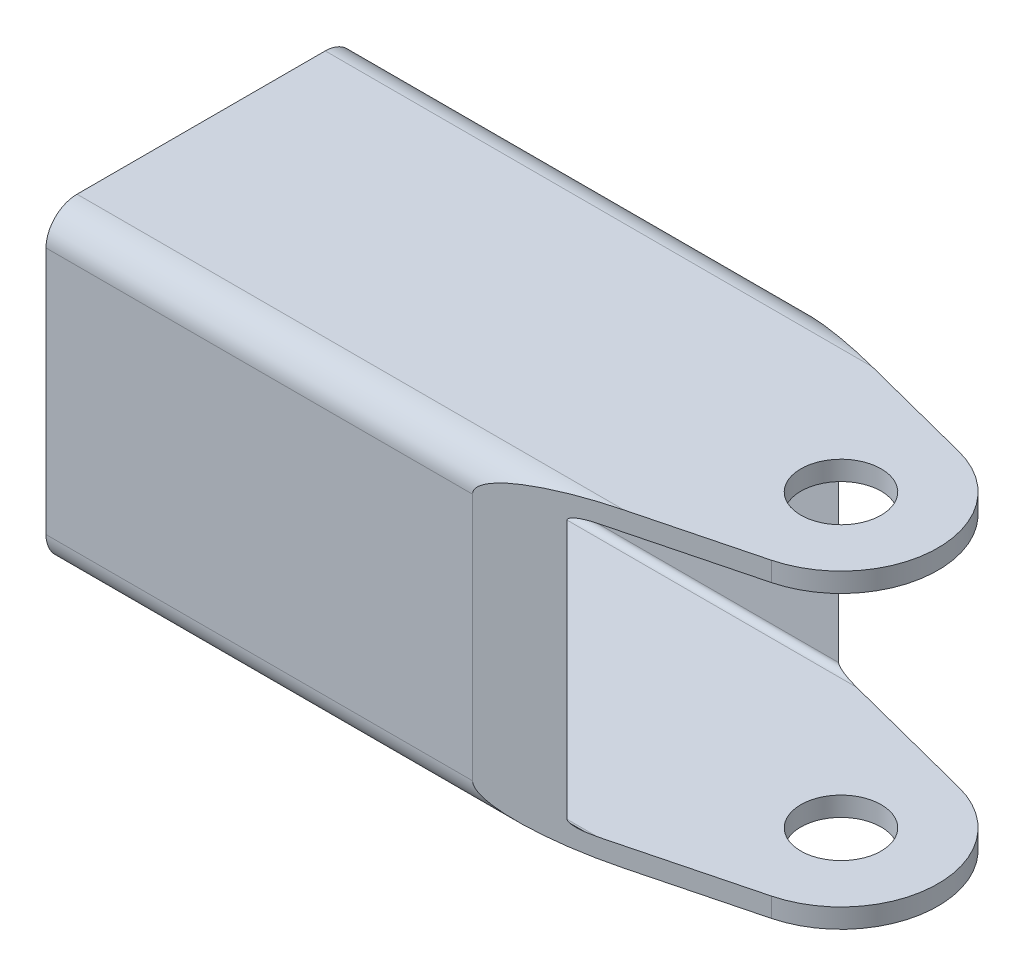
ISO-10303-21;
HEADER;
FILE_DESCRIPTION(('STEP AP214'),'2;1');
FILE_NAME('part.step','',(''),(''),'','','');
FILE_SCHEMA(('AUTOMOTIVE_DESIGN { 1 0 10303 214 1 1 1 1 }'));
ENDSEC;
DATA;
#1=APPLICATION_CONTEXT('core data for automotive mechanical design processes');
#2=APPLICATION_PROTOCOL_DEFINITION('international standard','automotive_design',2000,#1);
#3=PRODUCT_CONTEXT('',#1,'mechanical');
#4=PRODUCT('Part','Part','',(#3));
#5=PRODUCT_RELATED_PRODUCT_CATEGORY('part','',(#4));
#6=PRODUCT_DEFINITION_FORMATION('','',#4);
#7=PRODUCT_DEFINITION_CONTEXT('part definition',#1,'design');
#8=PRODUCT_DEFINITION('design','',#6,#7);
#9=PRODUCT_DEFINITION_SHAPE('','',#8);
#10=(LENGTH_UNIT() NAMED_UNIT(*) SI_UNIT(.MILLI.,.METRE.));
#11=(NAMED_UNIT(*) PLANE_ANGLE_UNIT() SI_UNIT($,.RADIAN.));
#12=(NAMED_UNIT(*) SI_UNIT($,.STERADIAN.) SOLID_ANGLE_UNIT());
#13=UNCERTAINTY_MEASURE_WITH_UNIT(LENGTH_MEASURE(1.E-05),#10,'distance_accuracy_value','');
#14=(GEOMETRIC_REPRESENTATION_CONTEXT(3) GLOBAL_UNCERTAINTY_ASSIGNED_CONTEXT((#13)) GLOBAL_UNIT_ASSIGNED_CONTEXT((#10,
#11,#12)) REPRESENTATION_CONTEXT('',''));
#15=CARTESIAN_POINT('',(0.,0.,0.));
#16=DIRECTION('',(0.,0.,1.));
#17=DIRECTION('',(1.,0.,0.));
#18=AXIS2_PLACEMENT_3D('',#15,#16,#17);
#19=CARTESIAN_POINT('',(-34.925,12.7,-10.16));
#20=DIRECTION('',(0.,1.,0.));
#21=DIRECTION('',(0.,0.,-1.));
#22=AXIS2_PLACEMENT_3D('',#19,#20,#21);
#23=PLANE('',#22);
#24=CARTESIAN_POINT('',(17.4625,12.7,0.));
#25=DIRECTION('',(0.,-1.,0.));
#26=DIRECTION('',(0.,0.,-1.));
#27=AXIS2_PLACEMENT_3D('',#24,#25,#26);
#28=CIRCLE('',#27,3.2893);
#29=CARTESIAN_POINT('',(17.4625,12.7,-3.2893));
#30=VERTEX_POINT('',#29);
#31=EDGE_CURVE('E563',#30,#30,#28,.T.);
#32=ORIENTED_EDGE('',*,*,#31,.T.);
#33=EDGE_LOOP('',(#32));
#34=FACE_BOUND('',#33,.T.);
#35=CARTESIAN_POINT('',(17.4625,12.7,0.));
#36=DIRECTION('',(0.,-1.,0.));
#37=DIRECTION('',(0.,0.,-1.));
#38=AXIS2_PLACEMENT_3D('',#35,#36,#37);
#39=CIRCLE('',#38,7.9375);
#40=CARTESIAN_POINT('',(19.4444244631501,12.7,-7.68608363683138));
#41=VERTEX_POINT('',#40);
#42=CARTESIAN_POINT('',(19.4444244631501,12.7,7.68608363683139));
#43=VERTEX_POINT('',#42);
#44=EDGE_CURVE('E209',#41,#43,#39,.T.);
#45=ORIENTED_EDGE('',*,*,#44,.F.);
#46=DIRECTION('',(-0.96832549755356,0.,-0.249691270948044));
#47=VECTOR('',#46,1.);
#48=CARTESIAN_POINT('',(3.07063678702943,12.7,-11.9082092189969));
#49=LINE('',#48,#47);
#50=CARTESIAN_POINT('',(9.85035141375776,12.7,-10.16));
#51=VERTEX_POINT('',#50);
#52=EDGE_CURVE('E197',#41,#51,#49,.T.);
#53=ORIENTED_EDGE('',*,*,#52,.T.);
#54=DIRECTION('',(1.,0.,0.));
#55=VECTOR('',#54,1.);
#56=CARTESIAN_POINT('',(-34.925,12.7,-10.16));
#57=LINE('',#56,#55);
#58=CARTESIAN_POINT('',(-34.925,12.7,-10.16));
#59=VERTEX_POINT('',#58);
#60=EDGE_CURVE('E311',#59,#51,#57,.T.);
#61=ORIENTED_EDGE('',*,*,#60,.F.);
#62=DIRECTION('',(0.,0.,-1.));
#63=VECTOR('',#62,1.);
#64=CARTESIAN_POINT('',(-34.925,12.7,-10.16));
#65=LINE('',#64,#63);
#66=CARTESIAN_POINT('',(-34.925,12.7,10.16));
#67=VERTEX_POINT('',#66);
#68=EDGE_CURVE('E307',#67,#59,#65,.T.);
#69=ORIENTED_EDGE('',*,*,#68,.F.);
#70=DIRECTION('',(1.,0.,0.));
#71=VECTOR('',#70,1.);
#72=CARTESIAN_POINT('',(-34.925,12.7,10.16));
#73=LINE('',#72,#71);
#74=CARTESIAN_POINT('',(9.85035141375773,12.7,10.16));
#75=VERTEX_POINT('',#74);
#76=EDGE_CURVE('E315',#67,#75,#73,.T.);
#77=ORIENTED_EDGE('',*,*,#76,.T.);
#78=DIRECTION('',(-0.968325497553561,0.,0.249691270948044));
#79=VECTOR('',#78,1.);
#80=CARTESIAN_POINT('',(3.07063678702942,12.7,11.9082092189968));
#81=LINE('',#80,#79);
#82=EDGE_CURVE('E207',#43,#75,#81,.T.);
#83=ORIENTED_EDGE('',*,*,#82,.F.);
#84=EDGE_LOOP('',(#45,#53,#61,#69,#77,#83));
#85=FACE_BOUND('',#84,.T.);
#86=ADVANCED_FACE('F37',(#34,#85),#23,.T.);
#87=CARTESIAN_POINT('',(-34.925,10.16,10.16));
#88=DIRECTION('',(1.,0.,0.));
#89=DIRECTION('',(0.,0.,1.));
#90=AXIS2_PLACEMENT_3D('',#87,#88,#89);
#91=CYLINDRICAL_SURFACE('',#90,2.54);
#92=ORIENTED_EDGE('',*,*,#76,.F.);
#93=CARTESIAN_POINT('',(-34.925,10.16,10.16));
#94=DIRECTION('',(-1.,0.,0.));
#95=DIRECTION('',(0.,0.,-1.));
#96=AXIS2_PLACEMENT_3D('',#93,#94,#95);
#97=CIRCLE('',#96,2.54);
#98=CARTESIAN_POINT('',(-34.925,10.16,12.7));
#99=VERTEX_POINT('',#98);
#100=EDGE_CURVE('E305',#99,#67,#97,.T.);
#101=ORIENTED_EDGE('',*,*,#100,.F.);
#102=DIRECTION('',(1.,0.,0.));
#103=VECTOR('',#102,1.);
#104=CARTESIAN_POINT('',(-34.925,10.16,12.7));
#105=LINE('',#104,#103);
#106=CARTESIAN_POINT('',(0.,10.16,12.7));
#107=VERTEX_POINT('',#106);
#108=EDGE_CURVE('E318',#99,#107,#105,.T.);
#109=ORIENTED_EDGE('',*,*,#108,.T.);
#110=CARTESIAN_POINT('',(9.85035141375777,10.16,10.16));
#111=DIRECTION('',(-0.249691270948044,0.,-0.968325497553561));
#112=DIRECTION('',(0.968325497553561,0.,-0.249691270948044));
#113=AXIS2_PLACEMENT_3D('',#110,#111,#112);
#114=ELLIPSE('',#113,10.1725622620125,2.54);
#115=EDGE_CURVE('E247',#75,#107,#114,.F.);
#116=ORIENTED_EDGE('',*,*,#115,.F.);
#117=EDGE_LOOP('',(#92,#101,#109,#116));
#118=FACE_BOUND('',#117,.T.);
#119=ADVANCED_FACE('F398',(#118),#91,.T.);
#120=CARTESIAN_POINT('',(-34.925,10.16,12.7));
#121=DIRECTION('',(0.,0.,1.));
#122=DIRECTION('',(-1.,0.,0.));
#123=AXIS2_PLACEMENT_3D('',#120,#121,#122);
#124=PLANE('',#123);
#125=ORIENTED_EDGE('',*,*,#108,.F.);
#126=DIRECTION('',(0.,1.,0.));
#127=VECTOR('',#126,1.);
#128=CARTESIAN_POINT('',(-34.925,10.16,12.7));
#129=LINE('',#128,#127);
#130=CARTESIAN_POINT('',(-34.925,-10.16,12.7));
#131=VERTEX_POINT('',#130);
#132=EDGE_CURVE('E303',#131,#99,#129,.T.);
#133=ORIENTED_EDGE('',*,*,#132,.F.);
#134=DIRECTION('',(1.,0.,0.));
#135=VECTOR('',#134,1.);
#136=CARTESIAN_POINT('',(-34.925,-10.16,12.7));
#137=LINE('',#136,#135);
#138=CARTESIAN_POINT('',(0.,-10.16,12.7));
#139=VERTEX_POINT('',#138);
#140=EDGE_CURVE('E321',#131,#139,#137,.T.);
#141=ORIENTED_EDGE('',*,*,#140,.T.);
#142=DIRECTION('',(0.,1.,0.));
#143=VECTOR('',#142,1.);
#144=CARTESIAN_POINT('',(0.,-12.7,12.7));
#145=LINE('',#144,#143);
#146=EDGE_CURVE('E215',#139,#107,#145,.T.);
#147=ORIENTED_EDGE('',*,*,#146,.T.);
#148=EDGE_LOOP('',(#125,#133,#141,#147));
#149=FACE_BOUND('',#148,.T.);
#150=ADVANCED_FACE('F404',(#149),#124,.T.);
#151=CARTESIAN_POINT('',(-34.925,-10.16,10.16));
#152=DIRECTION('',(1.,0.,0.));
#153=DIRECTION('',(0.,0.,1.));
#154=AXIS2_PLACEMENT_3D('',#151,#152,#153);
#155=CYLINDRICAL_SURFACE('',#154,2.54);
#156=ORIENTED_EDGE('',*,*,#140,.F.);
#157=CARTESIAN_POINT('',(-34.925,-10.16,10.16));
#158=DIRECTION('',(-1.,0.,0.));
#159=DIRECTION('',(0.,0.,-1.));
#160=AXIS2_PLACEMENT_3D('',#157,#158,#159);
#161=CIRCLE('',#160,2.54);
#162=CARTESIAN_POINT('',(-34.925,-12.7,10.16));
#163=VERTEX_POINT('',#162);
#164=EDGE_CURVE('E301',#163,#131,#161,.T.);
#165=ORIENTED_EDGE('',*,*,#164,.F.);
#166=DIRECTION('',(1.,0.,0.));
#167=VECTOR('',#166,1.);
#168=CARTESIAN_POINT('',(-34.925,-12.7,10.16));
#169=LINE('',#168,#167);
#170=CARTESIAN_POINT('',(9.85035141375775,-12.7,10.16));
#171=VERTEX_POINT('',#170);
#172=EDGE_CURVE('E324',#163,#171,#169,.T.);
#173=ORIENTED_EDGE('',*,*,#172,.T.);
#174=CARTESIAN_POINT('',(9.85035141375777,-10.16,10.16));
#175=DIRECTION('',(-0.249691270948044,0.,-0.968325497553561));
#176=DIRECTION('',(0.968325497553561,0.,-0.249691270948044));
#177=AXIS2_PLACEMENT_3D('',#174,#175,#176);
#178=ELLIPSE('',#177,10.1725622620125,2.54);
#179=EDGE_CURVE('E193',#139,#171,#178,.F.);
#180=ORIENTED_EDGE('',*,*,#179,.F.);
#181=EDGE_LOOP('',(#156,#165,#173,#180));
#182=FACE_BOUND('',#181,.T.);
#183=ADVANCED_FACE('F413',(#182),#155,.T.);
#184=CARTESIAN_POINT('',(-34.925,-12.7,-10.16));
#185=DIRECTION('',(0.,-1.,0.));
#186=DIRECTION('',(0.,0.,1.));
#187=AXIS2_PLACEMENT_3D('',#184,#185,#186);
#188=PLANE('',#187);
#189=CARTESIAN_POINT('',(17.4625,-12.7,0.));
#190=DIRECTION('',(0.,-1.,0.));
#191=DIRECTION('',(0.,0.,-1.));
#192=AXIS2_PLACEMENT_3D('',#189,#190,#191);
#193=CIRCLE('',#192,3.2893);
#194=CARTESIAN_POINT('',(17.4625,-12.7,-3.2893));
#195=VERTEX_POINT('',#194);
#196=EDGE_CURVE('E558',#195,#195,#193,.T.);
#197=ORIENTED_EDGE('',*,*,#196,.F.);
#198=EDGE_LOOP('',(#197));
#199=FACE_BOUND('',#198,.T.);
#200=ORIENTED_EDGE('',*,*,#172,.F.);
#201=DIRECTION('',(0.,0.,1.));
#202=VECTOR('',#201,1.);
#203=CARTESIAN_POINT('',(-34.925,-12.7,-10.16));
#204=LINE('',#203,#202);
#205=CARTESIAN_POINT('',(-34.925,-12.7,-10.16));
#206=VERTEX_POINT('',#205);
#207=EDGE_CURVE('E299',#206,#163,#204,.T.);
#208=ORIENTED_EDGE('',*,*,#207,.F.);
#209=DIRECTION('',(1.,0.,0.));
#210=VECTOR('',#209,1.);
#211=CARTESIAN_POINT('',(-34.925,-12.7,-10.16));
#212=LINE('',#211,#210);
#213=CARTESIAN_POINT('',(9.85035141375782,-12.7,-10.16));
#214=VERTEX_POINT('',#213);
#215=EDGE_CURVE('E326',#206,#214,#212,.T.);
#216=ORIENTED_EDGE('',*,*,#215,.T.);
#217=DIRECTION('',(-0.96832549755356,0.,-0.249691270948044));
#218=VECTOR('',#217,1.);
#219=CARTESIAN_POINT('',(3.07063678702943,-12.7,-11.9082092189969));
#220=LINE('',#219,#218);
#221=CARTESIAN_POINT('',(19.4444244631501,-12.7,-7.68608363683139));
#222=VERTEX_POINT('',#221);
#223=EDGE_CURVE('E202',#222,#214,#220,.T.);
#224=ORIENTED_EDGE('',*,*,#223,.F.);
#225=CARTESIAN_POINT('',(17.4625,-12.7,0.));
#226=DIRECTION('',(0.,-1.,0.));
#227=DIRECTION('',(0.,0.,-1.));
#228=AXIS2_PLACEMENT_3D('',#225,#226,#227);
#229=CIRCLE('',#228,7.9375);
#230=CARTESIAN_POINT('',(19.4444244631501,-12.7,7.68608363683138));
#231=VERTEX_POINT('',#230);
#232=EDGE_CURVE('E179',#222,#231,#229,.T.);
#233=ORIENTED_EDGE('',*,*,#232,.T.);
#234=DIRECTION('',(-0.968325497553561,0.,0.249691270948044));
#235=VECTOR('',#234,1.);
#236=CARTESIAN_POINT('',(3.07063678702942,-12.7,11.9082092189968));
#237=LINE('',#236,#235);
#238=EDGE_CURVE('E189',#231,#171,#237,.T.);
#239=ORIENTED_EDGE('',*,*,#238,.T.);
#240=EDGE_LOOP('',(#200,#208,#216,#224,#233,#239));
#241=FACE_BOUND('',#240,.T.);
#242=ADVANCED_FACE('F199',(#199,#241),#188,.T.);
#243=CARTESIAN_POINT('',(-34.925,10.6045,10.6045));
#244=DIRECTION('',(1.,0.,0.));
#245=DIRECTION('',(0.,0.,1.));
#246=AXIS2_PLACEMENT_3D('',#243,#244,#245);
#247=CYLINDRICAL_SURFACE('',#246,0.508000000000001);
#248=CARTESIAN_POINT('',(8.12653991635016,10.6045,10.6045));
#249=DIRECTION('',(-0.249691270948044,0.,-0.968325497553561));
#250=DIRECTION('',(0.968325497553561,0.,-0.249691270948044));
#251=AXIS2_PLACEMENT_3D('',#248,#249,#250);
#252=ELLIPSE('',#251,2.0345124524025,0.508000000000001);
#253=CARTESIAN_POINT('',(8.12653991635019,11.1125,10.6045));
#254=VERTEX_POINT('',#253);
#255=CARTESIAN_POINT('',(6.15646963359859,10.6045,11.1125));
#256=VERTEX_POINT('',#255);
#257=EDGE_CURVE('E235',#254,#256,#252,.F.);
#258=ORIENTED_EDGE('',*,*,#257,.T.);
#259=DIRECTION('',(1.,0.,0.));
#260=VECTOR('',#259,1.);
#261=CARTESIAN_POINT('',(-34.925,10.6045,11.1125));
#262=LINE('',#261,#260);
#263=CARTESIAN_POINT('',(-34.925,10.6045,11.1125));
#264=VERTEX_POINT('',#263);
#265=EDGE_CURVE('E269',#264,#256,#262,.T.);
#266=ORIENTED_EDGE('',*,*,#265,.F.);
#267=CARTESIAN_POINT('',(-34.925,10.6045,10.6045));
#268=DIRECTION('',(-1.,0.,0.));
#269=DIRECTION('',(0.,0.,-1.));
#270=AXIS2_PLACEMENT_3D('',#267,#268,#269);
#271=CIRCLE('',#270,0.508000000000001);
#272=CARTESIAN_POINT('',(-34.925,11.1125,10.6045));
#273=VERTEX_POINT('',#272);
#274=EDGE_CURVE('E250',#264,#273,#271,.T.);
#275=ORIENTED_EDGE('',*,*,#274,.T.);
#276=DIRECTION('',(1.,0.,0.));
#277=VECTOR('',#276,1.);
#278=CARTESIAN_POINT('',(-34.925,11.1125,10.6045));
#279=LINE('',#278,#277);
#280=EDGE_CURVE('E268',#273,#254,#279,.T.);
#281=ORIENTED_EDGE('',*,*,#280,.T.);
#282=EDGE_LOOP('',(#258,#266,#275,#281));
#283=FACE_BOUND('',#282,.T.);
#284=ADVANCED_FACE('F376',(#283),#247,.F.);
#285=CARTESIAN_POINT('',(-34.925,10.6045,11.1125));
#286=DIRECTION('',(0.,0.,1.));
#287=DIRECTION('',(0.,1.,0.));
#288=AXIS2_PLACEMENT_3D('',#285,#286,#287);
#289=PLANE('',#288);
#290=DIRECTION('',(0.,-1.,0.));
#291=VECTOR('',#290,1.);
#292=CARTESIAN_POINT('',(6.1564696335986,10.6045,11.1125));
#293=LINE('',#292,#291);
#294=CARTESIAN_POINT('',(6.15646963359857,-10.6045,11.1125));
#295=VERTEX_POINT('',#294);
#296=EDGE_CURVE('E238',#256,#295,#293,.T.);
#297=ORIENTED_EDGE('',*,*,#296,.T.);
#298=DIRECTION('',(1.,0.,0.));
#299=VECTOR('',#298,1.);
#300=CARTESIAN_POINT('',(-34.925,-10.6045,11.1125));
#301=LINE('',#300,#299);
#302=CARTESIAN_POINT('',(-34.925,-10.6045,11.1125));
#303=VERTEX_POINT('',#302);
#304=EDGE_CURVE('E273',#303,#295,#301,.T.);
#305=ORIENTED_EDGE('',*,*,#304,.F.);
#306=DIRECTION('',(0.,1.,0.));
#307=VECTOR('',#306,1.);
#308=CARTESIAN_POINT('',(-34.925,10.6045,11.1125));
#309=LINE('',#308,#307);
#310=EDGE_CURVE('E266',#303,#264,#309,.T.);
#311=ORIENTED_EDGE('',*,*,#310,.T.);
#312=ORIENTED_EDGE('',*,*,#265,.T.);
#313=EDGE_LOOP('',(#297,#305,#311,#312));
#314=FACE_BOUND('',#313,.T.);
#315=ADVANCED_FACE('F385',(#314),#289,.F.);
#316=CARTESIAN_POINT('',(-34.925,-10.6045,10.6045));
#317=DIRECTION('',(1.,0.,0.));
#318=DIRECTION('',(0.,0.,1.));
#319=AXIS2_PLACEMENT_3D('',#316,#317,#318);
#320=CYLINDRICAL_SURFACE('',#319,0.508);
#321=CARTESIAN_POINT('',(8.12653991635013,-10.6045,10.6045));
#322=DIRECTION('',(-0.249691270948044,0.,-0.968325497553561));
#323=DIRECTION('',(0.968325497553561,0.,-0.249691270948044));
#324=AXIS2_PLACEMENT_3D('',#321,#322,#323);
#325=ELLIPSE('',#324,2.03451245240249,0.508);
#326=CARTESIAN_POINT('',(8.12653991635014,-11.1125,10.6045));
#327=VERTEX_POINT('',#326);
#328=EDGE_CURVE('E241',#295,#327,#325,.F.);
#329=ORIENTED_EDGE('',*,*,#328,.T.);
#330=DIRECTION('',(1.,0.,0.));
#331=VECTOR('',#330,1.);
#332=CARTESIAN_POINT('',(-34.925,-11.1125,10.6045));
#333=LINE('',#332,#331);
#334=CARTESIAN_POINT('',(-34.925,-11.1125,10.6045));
#335=VERTEX_POINT('',#334);
#336=EDGE_CURVE('E276',#335,#327,#333,.T.);
#337=ORIENTED_EDGE('',*,*,#336,.F.);
#338=CARTESIAN_POINT('',(-34.925,-10.6045,10.6045));
#339=DIRECTION('',(-1.,0.,0.));
#340=DIRECTION('',(0.,0.,1.));
#341=AXIS2_PLACEMENT_3D('',#338,#339,#340);
#342=CIRCLE('',#341,0.508);
#343=EDGE_CURVE('E264',#335,#303,#342,.T.);
#344=ORIENTED_EDGE('',*,*,#343,.T.);
#345=ORIENTED_EDGE('',*,*,#304,.T.);
#346=EDGE_LOOP('',(#329,#337,#344,#345));
#347=FACE_BOUND('',#346,.T.);
#348=ADVANCED_FACE('F387',(#347),#320,.F.);
#349=CARTESIAN_POINT('',(-34.925,-11.1125,-10.6045));
#350=DIRECTION('',(0.,-1.,0.));
#351=DIRECTION('',(0.,0.,1.));
#352=AXIS2_PLACEMENT_3D('',#349,#350,#351);
#353=PLANE('',#352);
#354=CARTESIAN_POINT('',(17.4625,-11.1125,0.));
#355=DIRECTION('',(0.,1.,0.));
#356=DIRECTION('',(0.,0.,1.));
#357=AXIS2_PLACEMENT_3D('',#354,#355,#356);
#358=CIRCLE('',#357,3.2893);
#359=CARTESIAN_POINT('',(17.4625,-11.1125,3.2893));
#360=VERTEX_POINT('',#359);
#361=EDGE_CURVE('E210',#360,#360,#358,.T.);
#362=ORIENTED_EDGE('',*,*,#361,.F.);
#363=EDGE_LOOP('',(#362));
#364=FACE_BOUND('',#363,.T.);
#365=DIRECTION('',(0.968325497553561,0.,-0.249691270948044));
#366=VECTOR('',#365,1.);
#367=CARTESIAN_POINT('',(-27.1129568480424,-11.1125,19.6913150811901));
#368=LINE('',#367,#366);
#369=CARTESIAN_POINT('',(19.4444244631501,-11.1125,7.68608363683138));
#370=VERTEX_POINT('',#369);
#371=EDGE_CURVE('E244',#327,#370,#368,.T.);
#372=ORIENTED_EDGE('',*,*,#371,.T.);
#373=CARTESIAN_POINT('',(17.4625,-11.1125,0.));
#374=DIRECTION('',(0.,1.,0.));
#375=DIRECTION('',(0.,0.,1.));
#376=AXIS2_PLACEMENT_3D('',#373,#374,#375);
#377=CIRCLE('',#376,7.9375);
#378=CARTESIAN_POINT('',(19.4444244631501,-11.1125,-7.68608363683139));
#379=VERTEX_POINT('',#378);
#380=EDGE_CURVE('E182',#370,#379,#377,.T.);
#381=ORIENTED_EDGE('',*,*,#380,.T.);
#382=DIRECTION('',(0.96832549755356,0.,0.249691270948044));
#383=VECTOR('',#382,1.);
#384=CARTESIAN_POINT('',(-32.2409202823815,-11.1125,-21.0136056854654));
#385=LINE('',#384,#383);
#386=CARTESIAN_POINT('',(8.12653991635018,-11.1125,-10.6045));
#387=VERTEX_POINT('',#386);
#388=EDGE_CURVE('E227',#387,#379,#385,.T.);
#389=ORIENTED_EDGE('',*,*,#388,.F.);
#390=DIRECTION('',(1.,0.,0.));
#391=VECTOR('',#390,1.);
#392=CARTESIAN_POINT('',(-34.925,-11.1125,-10.6045));
#393=LINE('',#392,#391);
#394=CARTESIAN_POINT('',(-34.925,-11.1125,-10.6045));
#395=VERTEX_POINT('',#394);
#396=EDGE_CURVE('E279',#395,#387,#393,.T.);
#397=ORIENTED_EDGE('',*,*,#396,.F.);
#398=DIRECTION('',(0.,0.,1.));
#399=VECTOR('',#398,1.);
#400=CARTESIAN_POINT('',(-34.925,-11.1125,-10.6045));
#401=LINE('',#400,#399);
#402=EDGE_CURVE('E262',#395,#335,#401,.T.);
#403=ORIENTED_EDGE('',*,*,#402,.T.);
#404=ORIENTED_EDGE('',*,*,#336,.T.);
#405=EDGE_LOOP('',(#372,#381,#389,#397,#403,#404));
#406=FACE_BOUND('',#405,.T.);
#407=ADVANCED_FACE('F355',(#364,#406),#353,.F.);
#408=CARTESIAN_POINT('',(-34.925,11.1125,-10.6045));
#409=DIRECTION('',(0.,1.,0.));
#410=DIRECTION('',(0.,0.,-1.));
#411=AXIS2_PLACEMENT_3D('',#408,#409,#410);
#412=PLANE('',#411);
#413=CARTESIAN_POINT('',(17.4625,11.1125,0.));
#414=DIRECTION('',(0.,-1.,0.));
#415=DIRECTION('',(0.,0.,-1.));
#416=AXIS2_PLACEMENT_3D('',#413,#414,#415);
#417=CIRCLE('',#416,3.2893);
#418=CARTESIAN_POINT('',(17.4625,11.1125,-3.2893));
#419=VERTEX_POINT('',#418);
#420=EDGE_CURVE('E41',#419,#419,#417,.T.);
#421=ORIENTED_EDGE('',*,*,#420,.F.);
#422=EDGE_LOOP('',(#421));
#423=FACE_BOUND('',#422,.T.);
#424=DIRECTION('',(-0.968325497553561,0.,0.249691270948044));
#425=VECTOR('',#424,1.);
#426=CARTESIAN_POINT('',(-27.1129568480424,11.1125,19.6913150811901));
#427=LINE('',#426,#425);
#428=CARTESIAN_POINT('',(19.4444244631501,11.1125,7.68608363683139));
#429=VERTEX_POINT('',#428);
#430=EDGE_CURVE('E11',#429,#254,#427,.T.);
#431=ORIENTED_EDGE('',*,*,#430,.T.);
#432=ORIENTED_EDGE('',*,*,#280,.F.);
#433=DIRECTION('',(0.,0.,-1.));
#434=VECTOR('',#433,1.);
#435=CARTESIAN_POINT('',(-34.925,11.1125,-10.6045));
#436=LINE('',#435,#434);
#437=CARTESIAN_POINT('',(-34.925,11.1125,-10.6045));
#438=VERTEX_POINT('',#437);
#439=EDGE_CURVE('E253',#273,#438,#436,.T.);
#440=ORIENTED_EDGE('',*,*,#439,.T.);
#441=DIRECTION('',(1.,0.,0.));
#442=VECTOR('',#441,1.);
#443=CARTESIAN_POINT('',(-34.925,11.1125,-10.6045));
#444=LINE('',#443,#442);
#445=CARTESIAN_POINT('',(8.12653991635014,11.1125,-10.6045));
#446=VERTEX_POINT('',#445);
#447=EDGE_CURVE('E288',#438,#446,#444,.T.);
#448=ORIENTED_EDGE('',*,*,#447,.T.);
#449=DIRECTION('',(-0.96832549755356,0.,-0.249691270948044));
#450=VECTOR('',#449,1.);
#451=CARTESIAN_POINT('',(-32.2409202823815,11.1125,-21.0136056854654));
#452=LINE('',#451,#450);
#453=CARTESIAN_POINT('',(19.4444244631501,11.1125,-7.68608363683138));
#454=VERTEX_POINT('',#453);
#455=EDGE_CURVE('E46',#454,#446,#452,.T.);
#456=ORIENTED_EDGE('',*,*,#455,.F.);
#457=CARTESIAN_POINT('',(17.4625,11.1125,0.));
#458=DIRECTION('',(0.,-1.,0.));
#459=DIRECTION('',(0.,0.,-1.));
#460=AXIS2_PLACEMENT_3D('',#457,#458,#459);
#461=CIRCLE('',#460,7.9375);
#462=EDGE_CURVE('E314',#454,#429,#461,.T.);
#463=ORIENTED_EDGE('',*,*,#462,.T.);
#464=EDGE_LOOP('',(#431,#432,#440,#448,#456,#463));
#465=FACE_BOUND('',#464,.T.);
#466=ADVANCED_FACE('F341',(#423,#465),#412,.F.);
#467=CARTESIAN_POINT('',(-34.925,10.16,-10.16));
#468=DIRECTION('',(1.,0.,0.));
#469=DIRECTION('',(0.,0.,1.));
#470=AXIS2_PLACEMENT_3D('',#467,#468,#469);
#471=CYLINDRICAL_SURFACE('',#470,2.54);
#472=CARTESIAN_POINT('',(9.85035141375779,10.16,-10.16));
#473=DIRECTION('',(0.249691270948044,0.,-0.96832549755356));
#474=DIRECTION('',(0.96832549755356,0.,0.249691270948044));
#475=AXIS2_PLACEMENT_3D('',#472,#473,#474);
#476=ELLIPSE('',#475,10.1725622620125,2.54);
#477=CARTESIAN_POINT('',(0.,10.16,-12.7));
#478=VERTEX_POINT('',#477);
#479=EDGE_CURVE('E232',#51,#478,#476,.F.);
#480=ORIENTED_EDGE('',*,*,#479,.T.);
#481=DIRECTION('',(1.,0.,0.));
#482=VECTOR('',#481,1.);
#483=CARTESIAN_POINT('',(-34.925,10.16,-12.7));
#484=LINE('',#483,#482);
#485=CARTESIAN_POINT('',(-34.925,10.16,-12.7));
#486=VERTEX_POINT('',#485);
#487=EDGE_CURVE('E310',#486,#478,#484,.T.);
#488=ORIENTED_EDGE('',*,*,#487,.F.);
#489=CARTESIAN_POINT('',(-34.925,10.16,-10.16));
#490=DIRECTION('',(-1.,0.,0.));
#491=DIRECTION('',(0.,0.,1.));
#492=AXIS2_PLACEMENT_3D('',#489,#490,#491);
#493=CIRCLE('',#492,2.54);
#494=EDGE_CURVE('E272',#59,#486,#493,.T.);
#495=ORIENTED_EDGE('',*,*,#494,.F.);
#496=ORIENTED_EDGE('',*,*,#60,.T.);
#497=EDGE_LOOP('',(#480,#488,#495,#496));
#498=FACE_BOUND('',#497,.T.);
#499=ADVANCED_FACE('F39',(#498),#471,.T.);
#500=CARTESIAN_POINT('',(-34.925,-10.16,-10.16));
#501=DIRECTION('',(1.,0.,0.));
#502=DIRECTION('',(0.,0.,1.));
#503=AXIS2_PLACEMENT_3D('',#500,#501,#502);
#504=CYLINDRICAL_SURFACE('',#503,2.54);
#505=CARTESIAN_POINT('',(9.8503514137578,-10.16,-10.16));
#506=DIRECTION('',(0.249691270948044,0.,-0.96832549755356));
#507=DIRECTION('',(0.96832549755356,0.,0.249691270948044));
#508=AXIS2_PLACEMENT_3D('',#505,#506,#507);
#509=ELLIPSE('',#508,10.1725622620125,2.54);
#510=CARTESIAN_POINT('',(0.,-10.16,-12.7));
#511=VERTEX_POINT('',#510);
#512=EDGE_CURVE('E230',#511,#214,#509,.F.);
#513=ORIENTED_EDGE('',*,*,#512,.T.);
#514=ORIENTED_EDGE('',*,*,#215,.F.);
#515=CARTESIAN_POINT('',(-34.925,-10.16,-10.16));
#516=DIRECTION('',(-1.,0.,0.));
#517=DIRECTION('',(0.,0.,-1.));
#518=AXIS2_PLACEMENT_3D('',#515,#516,#517);
#519=CIRCLE('',#518,2.54);
#520=CARTESIAN_POINT('',(-34.925,-10.16,-12.7));
#521=VERTEX_POINT('',#520);
#522=EDGE_CURVE('E297',#521,#206,#519,.T.);
#523=ORIENTED_EDGE('',*,*,#522,.F.);
#524=DIRECTION('',(1.,0.,0.));
#525=VECTOR('',#524,1.);
#526=CARTESIAN_POINT('',(-34.925,-10.16,-12.7));
#527=LINE('',#526,#525);
#528=EDGE_CURVE('E328',#521,#511,#527,.T.);
#529=ORIENTED_EDGE('',*,*,#528,.T.);
#530=EDGE_LOOP('',(#513,#514,#523,#529));
#531=FACE_BOUND('',#530,.T.);
#532=ADVANCED_FACE('F360',(#531),#504,.T.);
#533=CARTESIAN_POINT('',(-34.925,10.16,-12.7));
#534=DIRECTION('',(0.,0.,-1.));
#535=DIRECTION('',(1.,0.,0.));
#536=AXIS2_PLACEMENT_3D('',#533,#534,#535);
#537=PLANE('',#536);
#538=DIRECTION('',(0.,1.,0.));
#539=VECTOR('',#538,1.);
#540=CARTESIAN_POINT('',(0.,-12.7,-12.7));
#541=LINE('',#540,#539);
#542=EDGE_CURVE('E53',#511,#478,#541,.T.);
#543=ORIENTED_EDGE('',*,*,#542,.F.);
#544=ORIENTED_EDGE('',*,*,#528,.F.);
#545=DIRECTION('',(0.,-1.,0.));
#546=VECTOR('',#545,1.);
#547=CARTESIAN_POINT('',(-34.925,10.16,-12.7));
#548=LINE('',#547,#546);
#549=EDGE_CURVE('E295',#486,#521,#548,.T.);
#550=ORIENTED_EDGE('',*,*,#549,.F.);
#551=ORIENTED_EDGE('',*,*,#487,.T.);
#552=EDGE_LOOP('',(#543,#544,#550,#551));
#553=FACE_BOUND('',#552,.T.);
#554=ADVANCED_FACE('F363',(#553),#537,.T.);
#555=CARTESIAN_POINT('',(-34.925,10.16,-10.16));
#556=DIRECTION('',(1.,0.,0.));
#557=DIRECTION('',(0.,0.,1.));
#558=AXIS2_PLACEMENT_3D('',#555,#556,#557);
#559=PLANE('',#558);
#560=ORIENTED_EDGE('',*,*,#310,.F.);
#561=ORIENTED_EDGE('',*,*,#343,.F.);
#562=ORIENTED_EDGE('',*,*,#402,.F.);
#563=CARTESIAN_POINT('',(-34.925,-10.6045,-10.6045));
#564=DIRECTION('',(-1.,0.,0.));
#565=DIRECTION('',(0.,0.,1.));
#566=AXIS2_PLACEMENT_3D('',#563,#564,#565);
#567=CIRCLE('',#566,0.508000000000001);
#568=CARTESIAN_POINT('',(-34.925,-10.6045,-11.1125));
#569=VERTEX_POINT('',#568);
#570=EDGE_CURVE('E260',#569,#395,#567,.T.);
#571=ORIENTED_EDGE('',*,*,#570,.F.);
#572=DIRECTION('',(0.,-1.,0.));
#573=VECTOR('',#572,1.);
#574=CARTESIAN_POINT('',(-34.925,10.6045,-11.1125));
#575=LINE('',#574,#573);
#576=CARTESIAN_POINT('',(-34.925,10.6045,-11.1125));
#577=VERTEX_POINT('',#576);
#578=EDGE_CURVE('E257',#577,#569,#575,.T.);
#579=ORIENTED_EDGE('',*,*,#578,.F.);
#580=CARTESIAN_POINT('',(-34.925,10.6045,-10.6045));
#581=DIRECTION('',(-1.,0.,0.));
#582=DIRECTION('',(0.,0.,1.));
#583=AXIS2_PLACEMENT_3D('',#580,#581,#582);
#584=CIRCLE('',#583,0.507999999999997);
#585=EDGE_CURVE('E61',#438,#577,#584,.T.);
#586=ORIENTED_EDGE('',*,*,#585,.F.);
#587=ORIENTED_EDGE('',*,*,#439,.F.);
#588=ORIENTED_EDGE('',*,*,#274,.F.);
#589=EDGE_LOOP('',(#560,#561,#562,#571,#579,#586,#587,#588));
#590=FACE_BOUND('',#589,.T.);
#591=ORIENTED_EDGE('',*,*,#494,.T.);
#592=ORIENTED_EDGE('',*,*,#549,.T.);
#593=ORIENTED_EDGE('',*,*,#522,.T.);
#594=ORIENTED_EDGE('',*,*,#207,.T.);
#595=ORIENTED_EDGE('',*,*,#164,.T.);
#596=ORIENTED_EDGE('',*,*,#132,.T.);
#597=ORIENTED_EDGE('',*,*,#100,.T.);
#598=ORIENTED_EDGE('',*,*,#68,.T.);
#599=EDGE_LOOP('',(#591,#592,#593,#594,#595,#596,#597,#598));
#600=FACE_BOUND('',#599,.T.);
#601=ADVANCED_FACE('F379',(#590,#600),#559,.F.);
#602=CARTESIAN_POINT('',(-34.925,-10.6045,-10.6045));
#603=DIRECTION('',(1.,0.,0.));
#604=DIRECTION('',(0.,0.,1.));
#605=AXIS2_PLACEMENT_3D('',#602,#603,#604);
#606=CYLINDRICAL_SURFACE('',#605,0.508000000000001);
#607=DIRECTION('',(1.,0.,0.));
#608=VECTOR('',#607,1.);
#609=CARTESIAN_POINT('',(-34.925,-10.6045,-11.1125));
#610=LINE('',#609,#608);
#611=CARTESIAN_POINT('',(6.15646963359864,-10.6045,-11.1125));
#612=VERTEX_POINT('',#611);
#613=EDGE_CURVE('E282',#569,#612,#610,.T.);
#614=ORIENTED_EDGE('',*,*,#613,.F.);
#615=ORIENTED_EDGE('',*,*,#570,.T.);
#616=ORIENTED_EDGE('',*,*,#396,.T.);
#617=CARTESIAN_POINT('',(8.12653991635019,-10.6045,-10.6045));
#618=DIRECTION('',(0.249691270948044,0.,-0.96832549755356));
#619=DIRECTION('',(0.968325497553561,0.,0.249691270948044));
#620=AXIS2_PLACEMENT_3D('',#617,#618,#619);
#621=ELLIPSE('',#620,2.03451245240249,0.508000000000001);
#622=EDGE_CURVE('E225',#612,#387,#621,.F.);
#623=ORIENTED_EDGE('',*,*,#622,.F.);
#624=EDGE_LOOP('',(#614,#615,#616,#623));
#625=FACE_BOUND('',#624,.T.);
#626=ADVANCED_FACE('F350',(#625),#606,.F.);
#627=CARTESIAN_POINT('',(-34.925,10.6045,-11.1125));
#628=DIRECTION('',(0.,0.,-1.));
#629=DIRECTION('',(1.,0.,0.));
#630=AXIS2_PLACEMENT_3D('',#627,#628,#629);
#631=PLANE('',#630);
#632=DIRECTION('',(1.,0.,0.));
#633=VECTOR('',#632,1.);
#634=CARTESIAN_POINT('',(-34.925,10.6045,-11.1125));
#635=LINE('',#634,#633);
#636=CARTESIAN_POINT('',(6.1564696335986,10.6045,-11.1125));
#637=VERTEX_POINT('',#636);
#638=EDGE_CURVE('E285',#577,#637,#635,.T.);
#639=ORIENTED_EDGE('',*,*,#638,.F.);
#640=ORIENTED_EDGE('',*,*,#578,.T.);
#641=ORIENTED_EDGE('',*,*,#613,.T.);
#642=DIRECTION('',(0.,-1.,0.));
#643=VECTOR('',#642,1.);
#644=CARTESIAN_POINT('',(6.15646963359863,10.6045,-11.1125));
#645=LINE('',#644,#643);
#646=EDGE_CURVE('E223',#637,#612,#645,.T.);
#647=ORIENTED_EDGE('',*,*,#646,.F.);
#648=EDGE_LOOP('',(#639,#640,#641,#647));
#649=FACE_BOUND('',#648,.T.);
#650=ADVANCED_FACE('F346',(#649),#631,.F.);
#651=CARTESIAN_POINT('',(-34.925,10.6045,-10.6045));
#652=DIRECTION('',(1.,0.,0.));
#653=DIRECTION('',(0.,0.,1.));
#654=AXIS2_PLACEMENT_3D('',#651,#652,#653);
#655=CYLINDRICAL_SURFACE('',#654,0.507999999999997);
#656=ORIENTED_EDGE('',*,*,#447,.F.);
#657=ORIENTED_EDGE('',*,*,#585,.T.);
#658=ORIENTED_EDGE('',*,*,#638,.T.);
#659=CARTESIAN_POINT('',(8.12653991635015,10.6045,-10.6045));
#660=DIRECTION('',(0.249691270948044,0.,-0.96832549755356));
#661=DIRECTION('',(0.968325497553561,0.,0.249691270948044));
#662=AXIS2_PLACEMENT_3D('',#659,#660,#661);
#663=ELLIPSE('',#662,2.03451245240248,0.507999999999997);
#664=EDGE_CURVE('E221',#446,#637,#663,.F.);
#665=ORIENTED_EDGE('',*,*,#664,.F.);
#666=EDGE_LOOP('',(#656,#657,#658,#665));
#667=FACE_BOUND('',#666,.T.);
#668=ADVANCED_FACE('F344',(#667),#655,.F.);
#669=CARTESIAN_POINT('',(3.07063678702942,-12.7,11.9082092189968));
#670=DIRECTION('',(0.249691270948044,0.,0.968325497553561));
#671=DIRECTION('',(-0.968325497553561,0.,0.249691270948044));
#672=AXIS2_PLACEMENT_3D('',#669,#670,#671);
#673=PLANE('',#672);
#674=ORIENTED_EDGE('',*,*,#82,.T.);
#675=ORIENTED_EDGE('',*,*,#115,.T.);
#676=ORIENTED_EDGE('',*,*,#146,.F.);
#677=ORIENTED_EDGE('',*,*,#179,.T.);
#678=ORIENTED_EDGE('',*,*,#238,.F.);
#679=DIRECTION('',(0.,1.,0.));
#680=VECTOR('',#679,1.);
#681=CARTESIAN_POINT('',(19.4444244631501,-12.7,7.68608363683138));
#682=LINE('',#681,#680);
#683=EDGE_CURVE('E175',#231,#370,#682,.T.);
#684=ORIENTED_EDGE('',*,*,#683,.T.);
#685=ORIENTED_EDGE('',*,*,#371,.F.);
#686=ORIENTED_EDGE('',*,*,#328,.F.);
#687=ORIENTED_EDGE('',*,*,#296,.F.);
#688=ORIENTED_EDGE('',*,*,#257,.F.);
#689=ORIENTED_EDGE('',*,*,#430,.F.);
#690=EDGE_CURVE('E186',#429,#43,#682,.T.);
#691=ORIENTED_EDGE('',*,*,#690,.T.);
#692=EDGE_LOOP('',(#674,#675,#676,#677,#678,#684,#685,#686,#687,#688,#689,#691));
#693=FACE_BOUND('',#692,.T.);
#694=ADVANCED_FACE('F191',(#693),#673,.T.);
#695=CARTESIAN_POINT('',(3.07063678702943,-12.7,-11.9082092189969));
#696=DIRECTION('',(-0.249691270948044,0.,0.96832549755356));
#697=DIRECTION('',(-0.968325497553561,0.,-0.249691270948044));
#698=AXIS2_PLACEMENT_3D('',#695,#696,#697);
#699=PLANE('',#698);
#700=ORIENTED_EDGE('',*,*,#479,.F.);
#701=ORIENTED_EDGE('',*,*,#52,.F.);
#702=DIRECTION('',(0.,1.,0.));
#703=VECTOR('',#702,1.);
#704=CARTESIAN_POINT('',(19.4444244631501,-12.7,-7.68608363683139));
#705=LINE('',#704,#703);
#706=EDGE_CURVE('E185',#454,#41,#705,.T.);
#707=ORIENTED_EDGE('',*,*,#706,.F.);
#708=ORIENTED_EDGE('',*,*,#455,.T.);
#709=ORIENTED_EDGE('',*,*,#664,.T.);
#710=ORIENTED_EDGE('',*,*,#646,.T.);
#711=ORIENTED_EDGE('',*,*,#622,.T.);
#712=ORIENTED_EDGE('',*,*,#388,.T.);
#713=EDGE_CURVE('E218',#222,#379,#705,.T.);
#714=ORIENTED_EDGE('',*,*,#713,.F.);
#715=ORIENTED_EDGE('',*,*,#223,.T.);
#716=ORIENTED_EDGE('',*,*,#512,.F.);
#717=ORIENTED_EDGE('',*,*,#542,.T.);
#718=EDGE_LOOP('',(#700,#701,#707,#708,#709,#710,#711,#712,#714,#715,#716,#717));
#719=FACE_BOUND('',#718,.T.);
#720=ADVANCED_FACE('F336',(#719),#699,.F.);
#721=CARTESIAN_POINT('',(17.4625,-12.7,0.));
#722=DIRECTION('',(0.,1.,0.));
#723=DIRECTION('',(0.,0.,-1.));
#724=AXIS2_PLACEMENT_3D('',#721,#722,#723);
#725=CYLINDRICAL_SURFACE('',#724,7.9375);
#726=ORIENTED_EDGE('',*,*,#713,.T.);
#727=ORIENTED_EDGE('',*,*,#380,.F.);
#728=ORIENTED_EDGE('',*,*,#683,.F.);
#729=ORIENTED_EDGE('',*,*,#232,.F.);
#730=EDGE_LOOP('',(#726,#727,#728,#729));
#731=FACE_BOUND('',#730,.T.);
#732=ADVANCED_FACE('F177',(#731),#725,.T.);
#733=ORIENTED_EDGE('',*,*,#706,.T.);
#734=ORIENTED_EDGE('',*,*,#44,.T.);
#735=ORIENTED_EDGE('',*,*,#690,.F.);
#736=ORIENTED_EDGE('',*,*,#462,.F.);
#737=EDGE_LOOP('',(#733,#734,#735,#736));
#738=FACE_BOUND('',#737,.T.);
#739=ADVANCED_FACE('F371',(#738),#725,.T.);
#740=CARTESIAN_POINT('',(17.4625,-12.7,0.));
#741=DIRECTION('',(0.,1.,0.));
#742=DIRECTION('',(0.,0.,-1.));
#743=AXIS2_PLACEMENT_3D('',#740,#741,#742);
#744=CYLINDRICAL_SURFACE('',#743,3.2893);
#745=ORIENTED_EDGE('',*,*,#31,.F.);
#746=EDGE_LOOP('',(#745));
#747=FACE_BOUND('',#746,.T.);
#748=ORIENTED_EDGE('',*,*,#420,.T.);
#749=EDGE_LOOP('',(#748));
#750=FACE_BOUND('',#749,.T.);
#751=ADVANCED_FACE('F534',(#747,#750),#744,.F.);
#752=ORIENTED_EDGE('',*,*,#196,.T.);
#753=EDGE_LOOP('',(#752));
#754=FACE_BOUND('',#753,.T.);
#755=ORIENTED_EDGE('',*,*,#361,.T.);
#756=EDGE_LOOP('',(#755));
#757=FACE_BOUND('',#756,.T.);
#758=ADVANCED_FACE('F542',(#754,#757),#744,.F.);
#759=CLOSED_SHELL('',(#86,#119,#150,#183,#242,#284,#315,#348,#407,#466,#499,#532,#554,#601,#626,
#650,#668,#694,#720,#732,#739,#751,#758));
#760=MANIFOLD_SOLID_BREP('B2',#759);
#761=ADVANCED_BREP_SHAPE_REPRESENTATION('',(#18,#760),#14);
#762=SHAPE_DEFINITION_REPRESENTATION(#9,#761);
ENDSEC;
END-ISO-10303-21;
